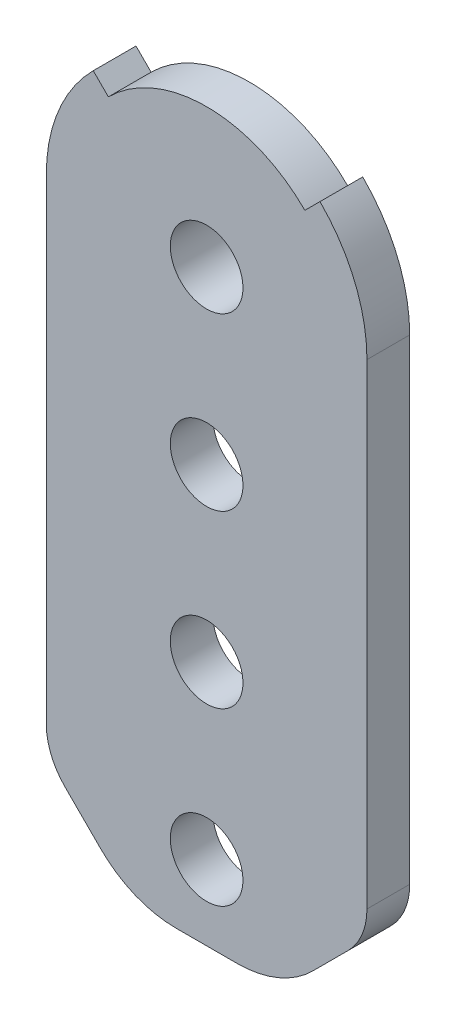
ISO-10303-21;
HEADER;
FILE_DESCRIPTION(('STEP AP214'),'2;1');
FILE_NAME('part.step','',(''),(''),'','','');
FILE_SCHEMA(('AUTOMOTIVE_DESIGN { 1 0 10303 214 1 1 1 1 }'));
ENDSEC;
DATA;
#1=APPLICATION_CONTEXT('core data for automotive mechanical design processes');
#2=APPLICATION_PROTOCOL_DEFINITION('international standard','automotive_design',2000,#1);
#3=PRODUCT_CONTEXT('',#1,'mechanical');
#4=PRODUCT('Part','Part','',(#3));
#5=PRODUCT_RELATED_PRODUCT_CATEGORY('part','',(#4));
#6=PRODUCT_DEFINITION_FORMATION('','',#4);
#7=PRODUCT_DEFINITION_CONTEXT('part definition',#1,'design');
#8=PRODUCT_DEFINITION('design','',#6,#7);
#9=PRODUCT_DEFINITION_SHAPE('','',#8);
#10=(LENGTH_UNIT() NAMED_UNIT(*) SI_UNIT(.MILLI.,.METRE.));
#11=(NAMED_UNIT(*) PLANE_ANGLE_UNIT() SI_UNIT($,.RADIAN.));
#12=(NAMED_UNIT(*) SI_UNIT($,.STERADIAN.) SOLID_ANGLE_UNIT());
#13=UNCERTAINTY_MEASURE_WITH_UNIT(LENGTH_MEASURE(1.E-05),#10,'distance_accuracy_value','');
#14=(GEOMETRIC_REPRESENTATION_CONTEXT(3) GLOBAL_UNCERTAINTY_ASSIGNED_CONTEXT((#13)) GLOBAL_UNIT_ASSIGNED_CONTEXT((#10,
#11,#12)) REPRESENTATION_CONTEXT('',''));
#15=CARTESIAN_POINT('',(0.,0.,0.));
#16=DIRECTION('',(0.,0.,1.));
#17=DIRECTION('',(1.,0.,0.));
#18=AXIS2_PLACEMENT_3D('',#15,#16,#17);
#19=CARTESIAN_POINT('',(0.,0.,0.));
#20=DIRECTION('',(0.,0.,1.));
#21=DIRECTION('',(1.,0.,0.));
#22=AXIS2_PLACEMENT_3D('',#19,#20,#21);
#23=PLANE('',#22);
#24=DIRECTION('',(-0.707106781186545,0.70710678118655,0.));
#25=VECTOR('',#24,1.);
#26=CARTESIAN_POINT('',(-15.5,-15.4999999999999,0.));
#27=LINE('',#26,#25);
#28=CARTESIAN_POINT('',(-4.96446609406725,-26.0355339059327,0.));
#29=VERTEX_POINT('',#28);
#30=CARTESIAN_POINT('',(-6.62132034355965,-24.3786796564403,0.));
#31=VERTEX_POINT('',#30);
#32=EDGE_CURVE('E361',#29,#31,#27,.T.);
#33=ORIENTED_EDGE('',*,*,#32,.T.);
#34=CARTESIAN_POINT('',(-4.5,-22.2573593128807,0.));
#35=DIRECTION('',(0.,0.,1.));
#36=DIRECTION('',(1.,0.,0.));
#37=AXIS2_PLACEMENT_3D('',#34,#35,#36);
#38=CIRCLE('',#37,3.);
#39=CARTESIAN_POINT('',(-7.5,-22.2573593128807,0.));
#40=VERTEX_POINT('',#39);
#41=EDGE_CURVE('E272',#31,#40,#38,.F.);
#42=ORIENTED_EDGE('',*,*,#41,.T.);
#43=DIRECTION('',(0.,-1.,0.));
#44=VECTOR('',#43,1.);
#45=CARTESIAN_POINT('',(-7.5,0.,0.));
#46=LINE('',#45,#44);
#47=CARTESIAN_POINT('',(-7.5,0.,0.));
#48=VERTEX_POINT('',#47);
#49=EDGE_CURVE('E207',#48,#40,#46,.T.);
#50=ORIENTED_EDGE('',*,*,#49,.F.);
#51=CARTESIAN_POINT('',(0.,0.,0.));
#52=DIRECTION('',(0.,0.,1.));
#53=DIRECTION('',(1.,0.,0.));
#54=AXIS2_PLACEMENT_3D('',#51,#52,#53);
#55=CIRCLE('',#54,7.5);
#56=CARTESIAN_POINT('',(-5.3033008588991,5.30330085889911,0.));
#57=VERTEX_POINT('',#56);
#58=EDGE_CURVE('E198',#57,#48,#55,.T.);
#59=ORIENTED_EDGE('',*,*,#58,.F.);
#60=DIRECTION('',(-0.707106781186546,0.707106781186549,0.));
#61=VECTOR('',#60,1.);
#62=CARTESIAN_POINT('',(0.,0.,0.));
#63=LINE('',#62,#61);
#64=CARTESIAN_POINT('',(-4.59619407771255,4.59619407771257,0.));
#65=VERTEX_POINT('',#64);
#66=EDGE_CURVE('E180',#65,#57,#63,.T.);
#67=ORIENTED_EDGE('',*,*,#66,.F.);
#68=CARTESIAN_POINT('',(0.,0.,0.));
#69=DIRECTION('',(0.,0.,-1.));
#70=DIRECTION('',(-1.,0.,0.));
#71=AXIS2_PLACEMENT_3D('',#68,#69,#70);
#72=CIRCLE('',#71,6.5);
#73=CARTESIAN_POINT('',(4.59619407771258,4.59619407771253,0.));
#74=VERTEX_POINT('',#73);
#75=EDGE_CURVE('E192',#65,#74,#72,.T.);
#76=ORIENTED_EDGE('',*,*,#75,.T.);
#77=DIRECTION('',(0.707106781186551,0.707106781186544,0.));
#78=VECTOR('',#77,1.);
#79=CARTESIAN_POINT('',(0.,0.,0.));
#80=LINE('',#79,#78);
#81=CARTESIAN_POINT('',(5.30330085889913,5.30330085889908,0.));
#82=VERTEX_POINT('',#81);
#83=EDGE_CURVE('E191',#74,#82,#80,.T.);
#84=ORIENTED_EDGE('',*,*,#83,.T.);
#85=CARTESIAN_POINT('',(7.5,0.,0.));
#86=VERTEX_POINT('',#85);
#87=EDGE_CURVE('E210',#86,#82,#55,.T.);
#88=ORIENTED_EDGE('',*,*,#87,.F.);
#89=DIRECTION('',(0.,-1.,0.));
#90=VECTOR('',#89,1.);
#91=CARTESIAN_POINT('',(7.5,0.,0.));
#92=LINE('',#91,#90);
#93=CARTESIAN_POINT('',(7.5,-22.2573593128807,0.));
#94=VERTEX_POINT('',#93);
#95=EDGE_CURVE('E225',#86,#94,#92,.T.);
#96=ORIENTED_EDGE('',*,*,#95,.T.);
#97=CARTESIAN_POINT('',(4.5,-22.2573593128807,0.));
#98=DIRECTION('',(0.,0.,1.));
#99=DIRECTION('',(1.,0.,0.));
#100=AXIS2_PLACEMENT_3D('',#97,#98,#99);
#101=CIRCLE('',#100,3.);
#102=CARTESIAN_POINT('',(6.62132034355964,-24.3786796564404,0.));
#103=VERTEX_POINT('',#102);
#104=EDGE_CURVE('E269',#94,#103,#101,.F.);
#105=ORIENTED_EDGE('',*,*,#104,.T.);
#106=DIRECTION('',(0.70710678118655,0.707106781186545,0.));
#107=VECTOR('',#106,1.);
#108=CARTESIAN_POINT('',(15.5,-15.5000000000001,0.));
#109=LINE('',#108,#107);
#110=CARTESIAN_POINT('',(4.96446609406724,-26.0355339059327,0.));
#111=VERTEX_POINT('',#110);
#112=EDGE_CURVE('E379',#111,#103,#109,.T.);
#113=ORIENTED_EDGE('',*,*,#112,.F.);
#114=CARTESIAN_POINT('',(1.42893218813452,-22.5,0.));
#115=DIRECTION('',(0.,0.,1.));
#116=DIRECTION('',(1.,0.,0.));
#117=AXIS2_PLACEMENT_3D('',#114,#115,#116);
#118=CIRCLE('',#117,5.);
#119=CARTESIAN_POINT('',(1.42893218813452,-27.5,0.));
#120=VERTEX_POINT('',#119);
#121=EDGE_CURVE('E246',#111,#120,#118,.F.);
#122=ORIENTED_EDGE('',*,*,#121,.T.);
#123=DIRECTION('',(-1.,0.,0.));
#124=VECTOR('',#123,1.);
#125=CARTESIAN_POINT('',(0.,-27.5,0.));
#126=LINE('',#125,#124);
#127=CARTESIAN_POINT('',(-1.4289321881345,-27.5,0.));
#128=VERTEX_POINT('',#127);
#129=EDGE_CURVE('E371',#120,#128,#126,.T.);
#130=ORIENTED_EDGE('',*,*,#129,.T.);
#131=CARTESIAN_POINT('',(-1.4289321881345,-22.5,0.));
#132=DIRECTION('',(0.,0.,1.));
#133=DIRECTION('',(1.,0.,0.));
#134=AXIS2_PLACEMENT_3D('',#131,#132,#133);
#135=CIRCLE('',#134,5.);
#136=EDGE_CURVE('E243',#128,#29,#135,.F.);
#137=ORIENTED_EDGE('',*,*,#136,.T.);
#138=EDGE_LOOP('',(#33,#42,#50,#59,#67,#76,#84,#88,#96,#105,#113,#122,#130,#137));
#139=FACE_BOUND('',#138,.T.);
#140=CARTESIAN_POINT('',(0.,-8.,0.));
#141=DIRECTION('',(0.,0.,-1.));
#142=DIRECTION('',(-1.,0.,0.));
#143=AXIS2_PLACEMENT_3D('',#140,#141,#142);
#144=CIRCLE('',#143,1.7);
#145=CARTESIAN_POINT('',(-1.7,-8.,0.));
#146=VERTEX_POINT('',#145);
#147=EDGE_CURVE('E217',#146,#146,#144,.T.);
#148=ORIENTED_EDGE('',*,*,#147,.F.);
#149=EDGE_LOOP('',(#148));
#150=FACE_BOUND('',#149,.T.);
#151=CARTESIAN_POINT('',(0.,-24.,0.));
#152=DIRECTION('',(0.,0.,-1.));
#153=DIRECTION('',(-1.,0.,0.));
#154=AXIS2_PLACEMENT_3D('',#151,#152,#153);
#155=CIRCLE('',#154,1.7);
#156=CARTESIAN_POINT('',(-1.7,-24.,0.));
#157=VERTEX_POINT('',#156);
#158=EDGE_CURVE('E313',#157,#157,#155,.T.);
#159=ORIENTED_EDGE('',*,*,#158,.F.);
#160=EDGE_LOOP('',(#159));
#161=FACE_BOUND('',#160,.T.);
#162=CARTESIAN_POINT('',(0.,-16.,0.));
#163=DIRECTION('',(0.,0.,-1.));
#164=DIRECTION('',(-1.,0.,0.));
#165=AXIS2_PLACEMENT_3D('',#162,#163,#164);
#166=CIRCLE('',#165,1.7);
#167=CARTESIAN_POINT('',(-1.7,-16.,0.));
#168=VERTEX_POINT('',#167);
#169=EDGE_CURVE('E322',#168,#168,#166,.T.);
#170=ORIENTED_EDGE('',*,*,#169,.F.);
#171=EDGE_LOOP('',(#170));
#172=FACE_BOUND('',#171,.T.);
#173=CARTESIAN_POINT('',(0.,0.,0.));
#174=DIRECTION('',(0.,0.,1.));
#175=DIRECTION('',(1.,0.,0.));
#176=AXIS2_PLACEMENT_3D('',#173,#174,#175);
#177=CIRCLE('',#176,2.74999999999999);
#178=CARTESIAN_POINT('',(2.74999999999999,0.,0.));
#179=VERTEX_POINT('',#178);
#180=EDGE_CURVE('E235',#179,#179,#177,.T.);
#181=ORIENTED_EDGE('',*,*,#180,.T.);
#182=EDGE_LOOP('',(#181));
#183=FACE_BOUND('',#182,.T.);
#184=ADVANCED_FACE('F77',(#139,#150,#161,#172,#183),#23,.F.);
#185=CARTESIAN_POINT('',(0.,0.,2.));
#186=DIRECTION('',(0.,0.,1.));
#187=DIRECTION('',(1.,0.,0.));
#188=AXIS2_PLACEMENT_3D('',#185,#186,#187);
#189=PLANE('',#188);
#190=DIRECTION('',(0.,-1.,0.));
#191=VECTOR('',#190,1.);
#192=CARTESIAN_POINT('',(-7.5,0.,2.));
#193=LINE('',#192,#191);
#194=CARTESIAN_POINT('',(-7.5,0.,2.));
#195=VERTEX_POINT('',#194);
#196=CARTESIAN_POINT('',(-7.5,-22.2573593128807,2.));
#197=VERTEX_POINT('',#196);
#198=EDGE_CURVE('E302',#195,#197,#193,.T.);
#199=ORIENTED_EDGE('',*,*,#198,.T.);
#200=CARTESIAN_POINT('',(-4.5,-22.2573593128807,2.));
#201=DIRECTION('',(0.,0.,1.));
#202=DIRECTION('',(1.,0.,0.));
#203=AXIS2_PLACEMENT_3D('',#200,#201,#202);
#204=CIRCLE('',#203,3.);
#205=CARTESIAN_POINT('',(-6.62132034355965,-24.3786796564403,2.));
#206=VERTEX_POINT('',#205);
#207=EDGE_CURVE('E280',#197,#206,#204,.T.);
#208=ORIENTED_EDGE('',*,*,#207,.T.);
#209=DIRECTION('',(-0.707106781186545,0.70710678118655,0.));
#210=VECTOR('',#209,1.);
#211=CARTESIAN_POINT('',(-15.5,-15.4999999999999,2.));
#212=LINE('',#211,#210);
#213=CARTESIAN_POINT('',(-4.96446609406725,-26.0355339059327,2.));
#214=VERTEX_POINT('',#213);
#215=EDGE_CURVE('E362',#214,#206,#212,.T.);
#216=ORIENTED_EDGE('',*,*,#215,.F.);
#217=CARTESIAN_POINT('',(-1.4289321881345,-22.5,2.));
#218=DIRECTION('',(0.,0.,1.));
#219=DIRECTION('',(1.,0.,0.));
#220=AXIS2_PLACEMENT_3D('',#217,#218,#219);
#221=CIRCLE('',#220,5.);
#222=CARTESIAN_POINT('',(-1.4289321881345,-27.5,2.));
#223=VERTEX_POINT('',#222);
#224=EDGE_CURVE('E256',#214,#223,#221,.T.);
#225=ORIENTED_EDGE('',*,*,#224,.T.);
#226=DIRECTION('',(-1.,0.,0.));
#227=VECTOR('',#226,1.);
#228=CARTESIAN_POINT('',(0.,-27.5,2.));
#229=LINE('',#228,#227);
#230=CARTESIAN_POINT('',(1.42893218813452,-27.5,2.));
#231=VERTEX_POINT('',#230);
#232=EDGE_CURVE('E366',#231,#223,#229,.T.);
#233=ORIENTED_EDGE('',*,*,#232,.F.);
#234=CARTESIAN_POINT('',(1.42893218813452,-22.5,2.));
#235=DIRECTION('',(0.,0.,1.));
#236=DIRECTION('',(1.,0.,0.));
#237=AXIS2_PLACEMENT_3D('',#234,#235,#236);
#238=CIRCLE('',#237,5.);
#239=CARTESIAN_POINT('',(4.96446609406724,-26.0355339059327,2.));
#240=VERTEX_POINT('',#239);
#241=EDGE_CURVE('E259',#231,#240,#238,.T.);
#242=ORIENTED_EDGE('',*,*,#241,.T.);
#243=DIRECTION('',(0.70710678118655,0.707106781186545,0.));
#244=VECTOR('',#243,1.);
#245=CARTESIAN_POINT('',(15.5,-15.5000000000001,2.));
#246=LINE('',#245,#244);
#247=CARTESIAN_POINT('',(6.62132034355964,-24.3786796564404,2.));
#248=VERTEX_POINT('',#247);
#249=EDGE_CURVE('E367',#240,#248,#246,.T.);
#250=ORIENTED_EDGE('',*,*,#249,.T.);
#251=CARTESIAN_POINT('',(4.5,-22.2573593128807,2.));
#252=DIRECTION('',(0.,0.,1.));
#253=DIRECTION('',(1.,0.,0.));
#254=AXIS2_PLACEMENT_3D('',#251,#252,#253);
#255=CIRCLE('',#254,3.);
#256=CARTESIAN_POINT('',(7.5,-22.2573593128807,2.));
#257=VERTEX_POINT('',#256);
#258=EDGE_CURVE('E93',#248,#257,#255,.T.);
#259=ORIENTED_EDGE('',*,*,#258,.T.);
#260=DIRECTION('',(0.,-1.,0.));
#261=VECTOR('',#260,1.);
#262=CARTESIAN_POINT('',(7.5,0.,2.));
#263=LINE('',#262,#261);
#264=CARTESIAN_POINT('',(7.5,0.,2.));
#265=VERTEX_POINT('',#264);
#266=EDGE_CURVE('E288',#265,#257,#263,.T.);
#267=ORIENTED_EDGE('',*,*,#266,.F.);
#268=CARTESIAN_POINT('',(0.,0.,2.));
#269=DIRECTION('',(0.,0.,1.));
#270=DIRECTION('',(1.,0.,0.));
#271=AXIS2_PLACEMENT_3D('',#268,#269,#270);
#272=CIRCLE('',#271,7.5);
#273=CARTESIAN_POINT('',(5.30330085889913,5.30330085889908,2.));
#274=VERTEX_POINT('',#273);
#275=EDGE_CURVE('E299',#265,#274,#272,.T.);
#276=ORIENTED_EDGE('',*,*,#275,.T.);
#277=DIRECTION('',(-0.707106781186551,-0.707106781186544,0.));
#278=VECTOR('',#277,1.);
#279=CARTESIAN_POINT('',(0.,0.,2.));
#280=LINE('',#279,#278);
#281=CARTESIAN_POINT('',(4.59619407771258,4.59619407771253,2.));
#282=VERTEX_POINT('',#281);
#283=EDGE_CURVE('E336',#274,#282,#280,.T.);
#284=ORIENTED_EDGE('',*,*,#283,.T.);
#285=CARTESIAN_POINT('',(0.,0.,2.));
#286=DIRECTION('',(0.,0.,1.));
#287=DIRECTION('',(1.,0.,0.));
#288=AXIS2_PLACEMENT_3D('',#285,#286,#287);
#289=CIRCLE('',#288,6.5);
#290=CARTESIAN_POINT('',(-4.59619407771255,4.59619407771257,2.));
#291=VERTEX_POINT('',#290);
#292=EDGE_CURVE('E318',#282,#291,#289,.T.);
#293=ORIENTED_EDGE('',*,*,#292,.T.);
#294=DIRECTION('',(0.707106781186546,-0.707106781186549,0.));
#295=VECTOR('',#294,1.);
#296=CARTESIAN_POINT('',(0.,0.,2.));
#297=LINE('',#296,#295);
#298=CARTESIAN_POINT('',(-5.3033008588991,5.30330085889911,2.));
#299=VERTEX_POINT('',#298);
#300=EDGE_CURVE('E339',#299,#291,#297,.T.);
#301=ORIENTED_EDGE('',*,*,#300,.F.);
#302=EDGE_CURVE('E200',#299,#195,#272,.T.);
#303=ORIENTED_EDGE('',*,*,#302,.T.);
#304=EDGE_LOOP('',(#199,#208,#216,#225,#233,#242,#250,#259,#267,#276,#284,#293,#301,#303));
#305=FACE_BOUND('',#304,.T.);
#306=CARTESIAN_POINT('',(0.,0.,2.));
#307=DIRECTION('',(0.,0.,1.));
#308=DIRECTION('',(1.,0.,0.));
#309=AXIS2_PLACEMENT_3D('',#306,#307,#308);
#310=CIRCLE('',#309,1.7);
#311=CARTESIAN_POINT('',(1.7,0.,2.));
#312=VERTEX_POINT('',#311);
#313=EDGE_CURVE('E221',#312,#312,#310,.T.);
#314=ORIENTED_EDGE('',*,*,#313,.F.);
#315=EDGE_LOOP('',(#314));
#316=FACE_BOUND('',#315,.T.);
#317=CARTESIAN_POINT('',(0.,-24.,2.));
#318=DIRECTION('',(0.,0.,-1.));
#319=DIRECTION('',(-1.,0.,0.));
#320=AXIS2_PLACEMENT_3D('',#317,#318,#319);
#321=CIRCLE('',#320,1.7);
#322=CARTESIAN_POINT('',(-1.7,-24.,2.));
#323=VERTEX_POINT('',#322);
#324=EDGE_CURVE('E317',#323,#323,#321,.T.);
#325=ORIENTED_EDGE('',*,*,#324,.T.);
#326=EDGE_LOOP('',(#325));
#327=FACE_BOUND('',#326,.T.);
#328=CARTESIAN_POINT('',(0.,-16.,2.));
#329=DIRECTION('',(0.,0.,-1.));
#330=DIRECTION('',(-1.,0.,0.));
#331=AXIS2_PLACEMENT_3D('',#328,#329,#330);
#332=CIRCLE('',#331,1.7);
#333=CARTESIAN_POINT('',(-1.7,-16.,2.));
#334=VERTEX_POINT('',#333);
#335=EDGE_CURVE('E326',#334,#334,#332,.T.);
#336=ORIENTED_EDGE('',*,*,#335,.T.);
#337=EDGE_LOOP('',(#336));
#338=FACE_BOUND('',#337,.T.);
#339=CARTESIAN_POINT('',(0.,-8.,2.));
#340=DIRECTION('',(0.,0.,-1.));
#341=DIRECTION('',(-1.,0.,0.));
#342=AXIS2_PLACEMENT_3D('',#339,#340,#341);
#343=CIRCLE('',#342,1.7);
#344=CARTESIAN_POINT('',(-1.7,-8.,2.));
#345=VERTEX_POINT('',#344);
#346=EDGE_CURVE('E211',#345,#345,#343,.T.);
#347=ORIENTED_EDGE('',*,*,#346,.T.);
#348=EDGE_LOOP('',(#347));
#349=FACE_BOUND('',#348,.T.);
#350=ADVANCED_FACE('F305',(#305,#316,#327,#338,#349),#189,.T.);
#351=CARTESIAN_POINT('',(-7.5,0.,2.));
#352=DIRECTION('',(1.,0.,0.));
#353=DIRECTION('',(0.,0.,-1.));
#354=AXIS2_PLACEMENT_3D('',#351,#352,#353);
#355=PLANE('',#354);
#356=ORIENTED_EDGE('',*,*,#49,.T.);
#357=DIRECTION('',(0.,0.,-1.));
#358=VECTOR('',#357,1.);
#359=CARTESIAN_POINT('',(-7.5,-22.2573593128807,2.));
#360=LINE('',#359,#358);
#361=EDGE_CURVE('E275',#40,#197,#360,.F.);
#362=ORIENTED_EDGE('',*,*,#361,.T.);
#363=ORIENTED_EDGE('',*,*,#198,.F.);
#364=DIRECTION('',(0.,0.,-1.));
#365=VECTOR('',#364,1.);
#366=CARTESIAN_POINT('',(-7.5,0.,2.));
#367=LINE('',#366,#365);
#368=EDGE_CURVE('E232',#195,#48,#367,.T.);
#369=ORIENTED_EDGE('',*,*,#368,.T.);
#370=EDGE_LOOP('',(#356,#362,#363,#369));
#371=FACE_BOUND('',#370,.T.);
#372=ADVANCED_FACE('F395',(#371),#355,.F.);
#373=CARTESIAN_POINT('',(7.5,0.,2.));
#374=DIRECTION('',(1.,0.,0.));
#375=DIRECTION('',(0.,0.,-1.));
#376=AXIS2_PLACEMENT_3D('',#373,#374,#375);
#377=PLANE('',#376);
#378=ORIENTED_EDGE('',*,*,#266,.T.);
#379=DIRECTION('',(0.,0.,-1.));
#380=VECTOR('',#379,1.);
#381=CARTESIAN_POINT('',(7.5,-22.2573593128807,0.));
#382=LINE('',#381,#380);
#383=EDGE_CURVE('E86',#257,#94,#382,.T.);
#384=ORIENTED_EDGE('',*,*,#383,.T.);
#385=ORIENTED_EDGE('',*,*,#95,.F.);
#386=DIRECTION('',(0.,0.,-1.));
#387=VECTOR('',#386,1.);
#388=CARTESIAN_POINT('',(7.5,0.,2.));
#389=LINE('',#388,#387);
#390=EDGE_CURVE('E229',#265,#86,#389,.T.);
#391=ORIENTED_EDGE('',*,*,#390,.F.);
#392=EDGE_LOOP('',(#378,#384,#385,#391));
#393=FACE_BOUND('',#392,.T.);
#394=ADVANCED_FACE('F287',(#393),#377,.T.);
#395=CARTESIAN_POINT('',(0.,0.,2.));
#396=DIRECTION('',(0.,0.,-1.));
#397=DIRECTION('',(-1.,0.,0.));
#398=AXIS2_PLACEMENT_3D('',#395,#396,#397);
#399=CYLINDRICAL_SURFACE('',#398,7.5);
#400=DIRECTION('',(0.,0.,-1.));
#401=VECTOR('',#400,1.);
#402=CARTESIAN_POINT('',(5.30330085889913,5.30330085889908,10.));
#403=LINE('',#402,#401);
#404=EDGE_CURVE('E202',#274,#82,#403,.T.);
#405=ORIENTED_EDGE('',*,*,#404,.F.);
#406=ORIENTED_EDGE('',*,*,#275,.F.);
#407=ORIENTED_EDGE('',*,*,#390,.T.);
#408=ORIENTED_EDGE('',*,*,#87,.T.);
#409=EDGE_LOOP('',(#405,#406,#407,#408));
#410=FACE_BOUND('',#409,.T.);
#411=ADVANCED_FACE('F296',(#410),#399,.T.);
#412=ORIENTED_EDGE('',*,*,#302,.F.);
#413=DIRECTION('',(0.,0.,-1.));
#414=VECTOR('',#413,1.);
#415=CARTESIAN_POINT('',(-5.3033008588991,5.30330085889911,10.));
#416=LINE('',#415,#414);
#417=EDGE_CURVE('E183',#299,#57,#416,.T.);
#418=ORIENTED_EDGE('',*,*,#417,.T.);
#419=ORIENTED_EDGE('',*,*,#58,.T.);
#420=ORIENTED_EDGE('',*,*,#368,.F.);
#421=EDGE_LOOP('',(#412,#418,#419,#420));
#422=FACE_BOUND('',#421,.T.);
#423=ADVANCED_FACE('F196',(#422),#399,.T.);
#424=CARTESIAN_POINT('',(0.,0.,2.));
#425=DIRECTION('',(0.,0.,-1.));
#426=DIRECTION('',(-1.,0.,0.));
#427=AXIS2_PLACEMENT_3D('',#424,#425,#426);
#428=CYLINDRICAL_SURFACE('',#427,1.7);
#429=ORIENTED_EDGE('',*,*,#313,.T.);
#430=EDGE_LOOP('',(#429));
#431=FACE_BOUND('',#430,.T.);
#432=CARTESIAN_POINT('',(0.,0.,-0.5));
#433=DIRECTION('',(0.,0.,-1.));
#434=DIRECTION('',(-1.,0.,0.));
#435=AXIS2_PLACEMENT_3D('',#432,#433,#434);
#436=CIRCLE('',#435,1.7);
#437=CARTESIAN_POINT('',(-1.7,0.,-0.5));
#438=VERTEX_POINT('',#437);
#439=EDGE_CURVE('E357',#438,#438,#436,.T.);
#440=ORIENTED_EDGE('',*,*,#439,.T.);
#441=EDGE_LOOP('',(#440));
#442=FACE_BOUND('',#441,.T.);
#443=ADVANCED_FACE('F399',(#431,#442),#428,.F.);
#444=CARTESIAN_POINT('',(0.,-24.,2.));
#445=DIRECTION('',(0.,0.,-1.));
#446=DIRECTION('',(-1.,0.,0.));
#447=AXIS2_PLACEMENT_3D('',#444,#445,#446);
#448=CYLINDRICAL_SURFACE('',#447,1.7);
#449=ORIENTED_EDGE('',*,*,#324,.F.);
#450=EDGE_LOOP('',(#449));
#451=FACE_BOUND('',#450,.T.);
#452=ORIENTED_EDGE('',*,*,#158,.T.);
#453=EDGE_LOOP('',(#452));
#454=FACE_BOUND('',#453,.T.);
#455=ADVANCED_FACE('F402',(#451,#454),#448,.F.);
#456=CARTESIAN_POINT('',(0.,-16.,2.));
#457=DIRECTION('',(0.,0.,-1.));
#458=DIRECTION('',(-1.,0.,0.));
#459=AXIS2_PLACEMENT_3D('',#456,#457,#458);
#460=CYLINDRICAL_SURFACE('',#459,1.7);
#461=ORIENTED_EDGE('',*,*,#335,.F.);
#462=EDGE_LOOP('',(#461));
#463=FACE_BOUND('',#462,.T.);
#464=ORIENTED_EDGE('',*,*,#169,.T.);
#465=EDGE_LOOP('',(#464));
#466=FACE_BOUND('',#465,.T.);
#467=ADVANCED_FACE('F461',(#463,#466),#460,.F.);
#468=CARTESIAN_POINT('',(0.,-8.,2.));
#469=DIRECTION('',(0.,0.,-1.));
#470=DIRECTION('',(-1.,0.,0.));
#471=AXIS2_PLACEMENT_3D('',#468,#469,#470);
#472=CYLINDRICAL_SURFACE('',#471,1.7);
#473=ORIENTED_EDGE('',*,*,#346,.F.);
#474=EDGE_LOOP('',(#473));
#475=FACE_BOUND('',#474,.T.);
#476=ORIENTED_EDGE('',*,*,#147,.T.);
#477=EDGE_LOOP('',(#476));
#478=FACE_BOUND('',#477,.T.);
#479=ADVANCED_FACE('F454',(#475,#478),#472,.F.);
#480=CARTESIAN_POINT('',(0.,0.,10.));
#481=DIRECTION('',(0.,0.,-1.));
#482=DIRECTION('',(-1.,0.,0.));
#483=AXIS2_PLACEMENT_3D('',#480,#481,#482);
#484=CYLINDRICAL_SURFACE('',#483,6.5);
#485=DIRECTION('',(0.,0.,-1.));
#486=VECTOR('',#485,1.);
#487=CARTESIAN_POINT('',(4.59619407771258,4.59619407771253,10.));
#488=LINE('',#487,#486);
#489=EDGE_CURVE('E342',#282,#74,#488,.T.);
#490=ORIENTED_EDGE('',*,*,#489,.T.);
#491=ORIENTED_EDGE('',*,*,#75,.F.);
#492=DIRECTION('',(0.,0.,-1.));
#493=VECTOR('',#492,1.);
#494=CARTESIAN_POINT('',(-4.59619407771255,4.59619407771257,10.));
#495=LINE('',#494,#493);
#496=EDGE_CURVE('E186',#291,#65,#495,.T.);
#497=ORIENTED_EDGE('',*,*,#496,.F.);
#498=ORIENTED_EDGE('',*,*,#292,.F.);
#499=EDGE_LOOP('',(#490,#491,#497,#498));
#500=FACE_BOUND('',#499,.T.);
#501=ADVANCED_FACE('F443',(#500),#484,.T.);
#502=CARTESIAN_POINT('',(0.,0.,10.));
#503=DIRECTION('',(-0.707106781186544,0.707106781186551,0.));
#504=DIRECTION('',(-0.707106781186551,-0.707106781186544,0.));
#505=AXIS2_PLACEMENT_3D('',#502,#503,#504);
#506=PLANE('',#505);
#507=ORIENTED_EDGE('',*,*,#404,.T.);
#508=ORIENTED_EDGE('',*,*,#83,.F.);
#509=ORIENTED_EDGE('',*,*,#489,.F.);
#510=ORIENTED_EDGE('',*,*,#283,.F.);
#511=EDGE_LOOP('',(#507,#508,#509,#510));
#512=FACE_BOUND('',#511,.T.);
#513=ADVANCED_FACE('F446',(#512),#506,.T.);
#514=CARTESIAN_POINT('',(0.,0.,10.));
#515=DIRECTION('',(-0.707106781186549,-0.707106781186546,0.));
#516=DIRECTION('',(0.707106781186546,-0.707106781186549,0.));
#517=AXIS2_PLACEMENT_3D('',#514,#515,#516);
#518=PLANE('',#517);
#519=ORIENTED_EDGE('',*,*,#300,.T.);
#520=ORIENTED_EDGE('',*,*,#496,.T.);
#521=ORIENTED_EDGE('',*,*,#66,.T.);
#522=ORIENTED_EDGE('',*,*,#417,.F.);
#523=EDGE_LOOP('',(#519,#520,#521,#522));
#524=FACE_BOUND('',#523,.T.);
#525=ADVANCED_FACE('F182',(#524),#518,.F.);
#526=CARTESIAN_POINT('',(0.,0.,-0.5));
#527=DIRECTION('',(0.,0.,-1.));
#528=DIRECTION('',(-1.,0.,0.));
#529=AXIS2_PLACEMENT_3D('',#526,#527,#528);
#530=PLANE('',#529);
#531=CARTESIAN_POINT('',(0.,0.,-0.5));
#532=DIRECTION('',(0.,0.,-1.));
#533=DIRECTION('',(-1.,0.,0.));
#534=AXIS2_PLACEMENT_3D('',#531,#532,#533);
#535=CIRCLE('',#534,2.25);
#536=CARTESIAN_POINT('',(-2.25,0.,-0.5));
#537=VERTEX_POINT('',#536);
#538=EDGE_CURVE('E353',#537,#537,#535,.T.);
#539=ORIENTED_EDGE('',*,*,#538,.T.);
#540=EDGE_LOOP('',(#539));
#541=FACE_BOUND('',#540,.T.);
#542=ORIENTED_EDGE('',*,*,#439,.F.);
#543=EDGE_LOOP('',(#542));
#544=FACE_BOUND('',#543,.T.);
#545=ADVANCED_FACE('F415',(#541,#544),#530,.T.);
#546=CARTESIAN_POINT('',(0.,0.,-0.499999999999997));
#547=DIRECTION('',(0.,0.,1.));
#548=DIRECTION('',(1.,0.,0.));
#549=AXIS2_PLACEMENT_3D('',#546,#547,#548);
#550=CONICAL_SURFACE('',#549,2.25,0.785398163397444);
#551=ORIENTED_EDGE('',*,*,#180,.F.);
#552=EDGE_LOOP('',(#551));
#553=FACE_BOUND('',#552,.T.);
#554=ORIENTED_EDGE('',*,*,#538,.F.);
#555=EDGE_LOOP('',(#554));
#556=FACE_BOUND('',#555,.T.);
#557=ADVANCED_FACE('F411',(#553,#556),#550,.T.);
#558=CARTESIAN_POINT('',(-15.5,-15.4999999999999,28.868010719069));
#559=DIRECTION('',(-0.70710678118655,-0.707106781186545,0.));
#560=DIRECTION('',(0.707106781186545,-0.70710678118655,0.));
#561=AXIS2_PLACEMENT_3D('',#558,#559,#560);
#562=PLANE('',#561);
#563=ORIENTED_EDGE('',*,*,#215,.T.);
#564=DIRECTION('',(0.,0.,-1.));
#565=VECTOR('',#564,1.);
#566=CARTESIAN_POINT('',(-6.62132034355965,-24.3786796564403,0.));
#567=LINE('',#566,#565);
#568=EDGE_CURVE('E265',#206,#31,#567,.T.);
#569=ORIENTED_EDGE('',*,*,#568,.T.);
#570=ORIENTED_EDGE('',*,*,#32,.F.);
#571=DIRECTION('',(0.,0.,-1.));
#572=VECTOR('',#571,1.);
#573=CARTESIAN_POINT('',(-4.96446609406725,-26.0355339059327,28.868010719069));
#574=LINE('',#573,#572);
#575=EDGE_CURVE('E262',#29,#214,#574,.F.);
#576=ORIENTED_EDGE('',*,*,#575,.T.);
#577=EDGE_LOOP('',(#563,#569,#570,#576));
#578=FACE_BOUND('',#577,.T.);
#579=ADVANCED_FACE('F414',(#578),#562,.T.);
#580=CARTESIAN_POINT('',(0.,-27.5,28.868010719069));
#581=DIRECTION('',(0.,-1.,0.));
#582=DIRECTION('',(0.,0.,-1.));
#583=AXIS2_PLACEMENT_3D('',#580,#581,#582);
#584=PLANE('',#583);
#585=ORIENTED_EDGE('',*,*,#129,.F.);
#586=DIRECTION('',(0.,0.,-1.));
#587=VECTOR('',#586,1.);
#588=CARTESIAN_POINT('',(1.42893218813452,-27.5,2.));
#589=LINE('',#588,#587);
#590=EDGE_CURVE('E253',#120,#231,#589,.F.);
#591=ORIENTED_EDGE('',*,*,#590,.T.);
#592=ORIENTED_EDGE('',*,*,#232,.T.);
#593=DIRECTION('',(0.,0.,-1.));
#594=VECTOR('',#593,1.);
#595=CARTESIAN_POINT('',(-1.4289321881345,-27.5,28.868010719069));
#596=LINE('',#595,#594);
#597=EDGE_CURVE('E249',#223,#128,#596,.T.);
#598=ORIENTED_EDGE('',*,*,#597,.T.);
#599=EDGE_LOOP('',(#585,#591,#592,#598));
#600=FACE_BOUND('',#599,.T.);
#601=ADVANCED_FACE('F433',(#600),#584,.T.);
#602=CARTESIAN_POINT('',(15.5,-15.5000000000001,28.868010719069));
#603=DIRECTION('',(-0.707106781186545,0.70710678118655,0.));
#604=DIRECTION('',(-0.70710678118655,-0.707106781186545,0.));
#605=AXIS2_PLACEMENT_3D('',#602,#603,#604);
#606=PLANE('',#605);
#607=ORIENTED_EDGE('',*,*,#112,.T.);
#608=DIRECTION('',(0.,0.,-1.));
#609=VECTOR('',#608,1.);
#610=CARTESIAN_POINT('',(6.62132034355964,-24.3786796564404,2.));
#611=LINE('',#610,#609);
#612=EDGE_CURVE('E12',#103,#248,#611,.F.);
#613=ORIENTED_EDGE('',*,*,#612,.T.);
#614=ORIENTED_EDGE('',*,*,#249,.F.);
#615=DIRECTION('',(0.,0.,-1.));
#616=VECTOR('',#615,1.);
#617=CARTESIAN_POINT('',(4.96446609406725,-26.0355339059327,0.));
#618=LINE('',#617,#616);
#619=EDGE_CURVE('E239',#240,#111,#618,.T.);
#620=ORIENTED_EDGE('',*,*,#619,.T.);
#621=EDGE_LOOP('',(#607,#613,#614,#620));
#622=FACE_BOUND('',#621,.T.);
#623=ADVANCED_FACE('F381',(#622),#606,.F.);
#624=CARTESIAN_POINT('',(1.42893218813452,-22.5,28.868010719069));
#625=DIRECTION('',(0.,0.,1.));
#626=DIRECTION('',(1.,0.,0.));
#627=AXIS2_PLACEMENT_3D('',#624,#625,#626);
#628=CYLINDRICAL_SURFACE('',#627,5.);
#629=ORIENTED_EDGE('',*,*,#241,.F.);
#630=ORIENTED_EDGE('',*,*,#590,.F.);
#631=ORIENTED_EDGE('',*,*,#121,.F.);
#632=ORIENTED_EDGE('',*,*,#619,.F.);
#633=EDGE_LOOP('',(#629,#630,#631,#632));
#634=FACE_BOUND('',#633,.T.);
#635=ADVANCED_FACE('F417',(#634),#628,.T.);
#636=CARTESIAN_POINT('',(-1.4289321881345,-22.5,28.868010719069));
#637=DIRECTION('',(0.,0.,-1.));
#638=DIRECTION('',(-1.,0.,0.));
#639=AXIS2_PLACEMENT_3D('',#636,#637,#638);
#640=CYLINDRICAL_SURFACE('',#639,5.);
#641=ORIENTED_EDGE('',*,*,#224,.F.);
#642=ORIENTED_EDGE('',*,*,#575,.F.);
#643=ORIENTED_EDGE('',*,*,#136,.F.);
#644=ORIENTED_EDGE('',*,*,#597,.F.);
#645=EDGE_LOOP('',(#641,#642,#643,#644));
#646=FACE_BOUND('',#645,.T.);
#647=ADVANCED_FACE('F388',(#646),#640,.T.);
#648=CARTESIAN_POINT('',(-4.5,-22.2573593128807,28.868010719069));
#649=DIRECTION('',(0.,0.,1.));
#650=DIRECTION('',(1.,0.,0.));
#651=AXIS2_PLACEMENT_3D('',#648,#649,#650);
#652=CYLINDRICAL_SURFACE('',#651,3.);
#653=ORIENTED_EDGE('',*,*,#207,.F.);
#654=ORIENTED_EDGE('',*,*,#361,.F.);
#655=ORIENTED_EDGE('',*,*,#41,.F.);
#656=ORIENTED_EDGE('',*,*,#568,.F.);
#657=EDGE_LOOP('',(#653,#654,#655,#656));
#658=FACE_BOUND('',#657,.T.);
#659=ADVANCED_FACE('F384',(#658),#652,.T.);
#660=CARTESIAN_POINT('',(4.5,-22.2573593128807,2.));
#661=DIRECTION('',(0.,0.,1.));
#662=DIRECTION('',(1.,0.,0.));
#663=AXIS2_PLACEMENT_3D('',#660,#661,#662);
#664=CYLINDRICAL_SURFACE('',#663,3.);
#665=ORIENTED_EDGE('',*,*,#258,.F.);
#666=ORIENTED_EDGE('',*,*,#612,.F.);
#667=ORIENTED_EDGE('',*,*,#104,.F.);
#668=ORIENTED_EDGE('',*,*,#383,.F.);
#669=EDGE_LOOP('',(#665,#666,#667,#668));
#670=FACE_BOUND('',#669,.T.);
#671=ADVANCED_FACE('F79',(#670),#664,.T.);
#672=CLOSED_SHELL('',(#184,#350,#372,#394,#411,#423,#443,#455,#467,#479,#501,#513,#525,#545,
#557,#579,#601,#623,#635,#647,#659,#671));
#673=MANIFOLD_SOLID_BREP('B2',#672);
#674=ADVANCED_BREP_SHAPE_REPRESENTATION('',(#18,#673),#14);
#675=SHAPE_DEFINITION_REPRESENTATION(#9,#674);
ENDSEC;
END-ISO-10303-21;
